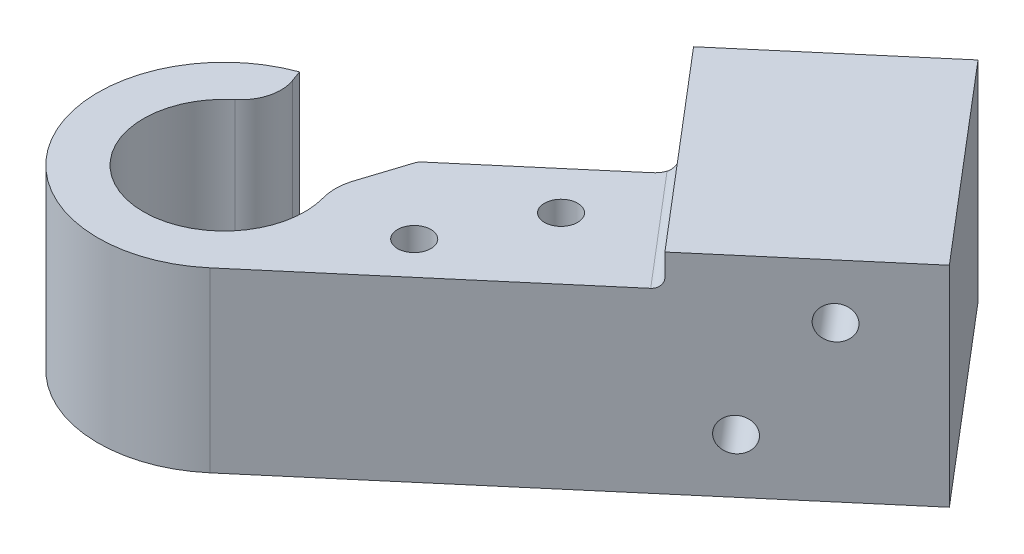
ISO-10303-21;
HEADER;
FILE_DESCRIPTION(('STEP AP214'),'2;1');
FILE_NAME('part.step','',(''),(''),'','','');
FILE_SCHEMA(('AUTOMOTIVE_DESIGN { 1 0 10303 214 1 1 1 1 }'));
ENDSEC;
DATA;
#1=APPLICATION_CONTEXT('core data for automotive mechanical design processes');
#2=APPLICATION_PROTOCOL_DEFINITION('international standard','automotive_design',2000,#1);
#3=PRODUCT_CONTEXT('',#1,'mechanical');
#4=PRODUCT('Part','Part','',(#3));
#5=PRODUCT_RELATED_PRODUCT_CATEGORY('part','',(#4));
#6=PRODUCT_DEFINITION_FORMATION('','',#4);
#7=PRODUCT_DEFINITION_CONTEXT('part definition',#1,'design');
#8=PRODUCT_DEFINITION('design','',#6,#7);
#9=PRODUCT_DEFINITION_SHAPE('','',#8);
#10=(LENGTH_UNIT() NAMED_UNIT(*) SI_UNIT(.MILLI.,.METRE.));
#11=(NAMED_UNIT(*) PLANE_ANGLE_UNIT() SI_UNIT($,.RADIAN.));
#12=(NAMED_UNIT(*) SI_UNIT($,.STERADIAN.) SOLID_ANGLE_UNIT());
#13=UNCERTAINTY_MEASURE_WITH_UNIT(LENGTH_MEASURE(1.E-05),#10,'distance_accuracy_value','');
#14=(GEOMETRIC_REPRESENTATION_CONTEXT(3) GLOBAL_UNCERTAINTY_ASSIGNED_CONTEXT((#13)) GLOBAL_UNIT_ASSIGNED_CONTEXT((#10,
#11,#12)) REPRESENTATION_CONTEXT('',''));
#15=CARTESIAN_POINT('',(0.,0.,0.));
#16=DIRECTION('',(0.,0.,1.));
#17=DIRECTION('',(1.,0.,0.));
#18=AXIS2_PLACEMENT_3D('',#15,#16,#17);
#19=CARTESIAN_POINT('',(0.,17.6,0.));
#20=DIRECTION('',(0.,-1.,0.));
#21=DIRECTION('',(0.,0.,-1.));
#22=AXIS2_PLACEMENT_3D('',#19,#20,#21);
#23=CYLINDRICAL_SURFACE('',#22,12.5);
#24=DIRECTION('',(0.,1.,0.));
#25=VECTOR('',#24,1.);
#26=CARTESIAN_POINT('',(8.10037181798933,0.,9.52018783482365));
#27=LINE('',#26,#25);
#28=CARTESIAN_POINT('',(8.10037181798933,0.,9.52018783482365));
#29=VERTEX_POINT('',#28);
#30=CARTESIAN_POINT('',(8.10037181798933,17.6,9.52018783482365));
#31=VERTEX_POINT('',#30);
#32=EDGE_CURVE('E294',#29,#31,#27,.T.);
#33=ORIENTED_EDGE('',*,*,#32,.T.);
#34=CARTESIAN_POINT('',(0.,17.6,0.));
#35=DIRECTION('',(0.,1.,0.));
#36=DIRECTION('',(0.,0.,1.));
#37=AXIS2_PLACEMENT_3D('',#34,#35,#36);
#38=CIRCLE('',#37,12.5);
#39=CARTESIAN_POINT('',(-4.27525179157087,17.6,-11.7461577598239));
#40=VERTEX_POINT('',#39);
#41=EDGE_CURVE('E318',#40,#31,#38,.T.);
#42=ORIENTED_EDGE('',*,*,#41,.F.);
#43=DIRECTION('',(0.,1.,0.));
#44=VECTOR('',#43,1.);
#45=CARTESIAN_POINT('',(-4.27525179157087,0.,-11.7461577598239));
#46=LINE('',#45,#44);
#47=CARTESIAN_POINT('',(-4.27525179157087,0.,-11.7461577598239));
#48=VERTEX_POINT('',#47);
#49=EDGE_CURVE('E307',#48,#40,#46,.T.);
#50=ORIENTED_EDGE('',*,*,#49,.F.);
#51=CARTESIAN_POINT('',(0.,0.,0.));
#52=DIRECTION('',(0.,1.,0.));
#53=DIRECTION('',(0.,0.,1.));
#54=AXIS2_PLACEMENT_3D('',#51,#52,#53);
#55=CIRCLE('',#54,12.5);
#56=EDGE_CURVE('E322',#48,#29,#55,.T.);
#57=ORIENTED_EDGE('',*,*,#56,.T.);
#58=EDGE_LOOP('',(#33,#42,#50,#57));
#59=FACE_BOUND('',#58,.T.);
#60=ADVANCED_FACE('F40',(#59),#23,.T.);
#61=CARTESIAN_POINT('',(0.,17.6,0.));
#62=DIRECTION('',(0.,1.,0.));
#63=DIRECTION('',(0.,0.,1.));
#64=AXIS2_PLACEMENT_3D('',#61,#62,#63);
#65=PLANE('',#64);
#66=DIRECTION('',(-0.761615026785892,0.,0.648029745439147));
#67=VECTOR('',#66,1.);
#68=CARTESIAN_POINT('',(-0.972044618158711,17.6,-1.14242254017883));
#69=LINE('',#68,#67);
#70=CARTESIAN_POINT('',(21.876406185418,17.6,-20.5833149033532));
#71=VERTEX_POINT('',#70);
#72=CARTESIAN_POINT('',(9.54279181840695,17.6,-10.0891036581677));
#73=VERTEX_POINT('',#72);
#74=EDGE_CURVE('E287',#71,#73,#69,.T.);
#75=ORIENTED_EDGE('',*,*,#74,.T.);
#76=CARTESIAN_POINT('',(10.1908215638461,17.6,-9.32748863138178));
#77=DIRECTION('',(0.,1.,0.));
#78=DIRECTION('',(0.,0.,1.));
#79=AXIS2_PLACEMENT_3D('',#76,#77,#78);
#80=CIRCLE('',#79,1.);
#81=CARTESIAN_POINT('',(9.23878749125801,17.6,-9.63348066498943));
#82=VERTEX_POINT('',#81);
#83=EDGE_CURVE('E62',#73,#82,#80,.T.);
#84=ORIENTED_EDGE('',*,*,#83,.T.);
#85=DIRECTION('',(0.30599203360765,0.,-0.952034072588085));
#86=VECTOR('',#85,1.);
#87=CARTESIAN_POINT('',(7.23783197852432,17.6,-3.40790085692802));
#88=LINE('',#87,#86);
#89=CARTESIAN_POINT('',(7.75951698939262,17.6,-5.03102123574787));
#90=VERTEX_POINT('',#89);
#91=EDGE_CURVE('E206',#90,#82,#88,.T.);
#92=ORIENTED_EDGE('',*,*,#91,.F.);
#93=CARTESIAN_POINT('',(12.519687352333,17.6,-3.50106106770962));
#94=DIRECTION('',(0.,1.,0.));
#95=DIRECTION('',(0.,0.,1.));
#96=AXIS2_PLACEMENT_3D('',#93,#94,#95);
#97=CIRCLE('',#96,5.);
#98=CARTESIAN_POINT('',(7.7044229860511,17.6,-2.15449911859054));
#99=VERTEX_POINT('',#98);
#100=EDGE_CURVE('E522',#90,#99,#97,.T.);
#101=ORIENTED_EDGE('',*,*,#100,.T.);
#102=CARTESIAN_POINT('',(0.,17.6,0.));
#103=DIRECTION('',(0.,1.,0.));
#104=DIRECTION('',(0.,0.,1.));
#105=AXIS2_PLACEMENT_3D('',#102,#103,#104);
#106=CIRCLE('',#105,8.);
#107=CARTESIAN_POINT('',(-5.0855244570075,17.6,-6.17555187794408));
#108=VERTEX_POINT('',#107);
#109=EDGE_CURVE('E311',#108,#99,#106,.T.);
#110=ORIENTED_EDGE('',*,*,#109,.F.);
#111=CARTESIAN_POINT('',(-7.62828668551125,17.6,-9.26332781691611));
#112=DIRECTION('',(0.,1.,0.));
#113=DIRECTION('',(0.,0.,1.));
#114=AXIS2_PLACEMENT_3D('',#111,#112,#113);
#115=CIRCLE('',#114,4.);
#116=CARTESIAN_POINT('',(-3.86951620236762,17.6,-10.6314083902188));
#117=VERTEX_POINT('',#116);
#118=EDGE_CURVE('E336',#108,#117,#115,.T.);
#119=ORIENTED_EDGE('',*,*,#118,.T.);
#120=DIRECTION('',(-0.34202014332567,0.,-0.939692620785908));
#121=VECTOR('',#120,1.);
#122=CARTESIAN_POINT('',(0.,17.6,0.));
#123=LINE('',#122,#121);
#124=EDGE_CURVE('E299',#117,#40,#123,.T.);
#125=ORIENTED_EDGE('',*,*,#124,.T.);
#126=ORIENTED_EDGE('',*,*,#41,.T.);
#127=DIRECTION('',(0.761615026785892,0.,-0.648029745439146));
#128=VECTOR('',#127,1.);
#129=CARTESIAN_POINT('',(8.10037181798933,17.6,9.52018783482365));
#130=LINE('',#129,#128);
#131=CARTESIAN_POINT('',(31.710437648352,17.6,-10.5687342737899));
#132=VERTEX_POINT('',#131);
#133=EDGE_CURVE('E292',#31,#132,#130,.T.);
#134=ORIENTED_EDGE('',*,*,#133,.T.);
#135=DIRECTION('',(-0.648029745439148,0.,-0.761615026785891));
#136=VECTOR('',#135,1.);
#137=CARTESIAN_POINT('',(22.6380212122039,17.6,-21.2313446487924));
#138=LINE('',#137,#136);
#139=CARTESIAN_POINT('',(22.4643821652422,17.6,-21.4354187801631));
#140=VERTEX_POINT('',#139);
#141=EDGE_CURVE('E341',#132,#140,#138,.T.);
#142=ORIENTED_EDGE('',*,*,#141,.T.);
#143=CARTESIAN_POINT('',(20.5803466945397,17.6,-22.106544956925));
#144=DIRECTION('',(0.,1.,0.));
#145=DIRECTION('',(0.,0.,1.));
#146=AXIS2_PLACEMENT_3D('',#143,#144,#145);
#147=CIRCLE('',#146,2.);
#148=EDGE_CURVE('E377',#140,#71,#147,.F.);
#149=ORIENTED_EDGE('',*,*,#148,.T.);
#150=EDGE_LOOP('',(#75,#84,#92,#101,#110,#119,#125,#126,#134,#142,#149));
#151=FACE_BOUND('',#150,.T.);
#152=CARTESIAN_POINT('',(20.7850198838034,17.6,-12.6071628377436));
#153=DIRECTION('',(0.,1.,0.));
#154=DIRECTION('',(0.,0.,1.));
#155=AXIS2_PLACEMENT_3D('',#152,#153,#154);
#156=CIRCLE('',#155,1.64999999999999);
#157=CARTESIAN_POINT('',(20.7850198838034,17.6,-10.9571628377436));
#158=VERTEX_POINT('',#157);
#159=EDGE_CURVE('E217',#158,#158,#156,.T.);
#160=ORIENTED_EDGE('',*,*,#159,.F.);
#161=EDGE_LOOP('',(#160));
#162=FACE_BOUND('',#161,.T.);
#163=CARTESIAN_POINT('',(15.7609885977011,17.6,-3.08040527620853));
#164=DIRECTION('',(0.,1.,0.));
#165=DIRECTION('',(0.,0.,1.));
#166=AXIS2_PLACEMENT_3D('',#163,#164,#165);
#167=CIRCLE('',#166,1.64999999999999);
#168=CARTESIAN_POINT('',(15.7609885977011,17.6,-1.43040527620854));
#169=VERTEX_POINT('',#168);
#170=EDGE_CURVE('E230',#169,#169,#167,.T.);
#171=ORIENTED_EDGE('',*,*,#170,.F.);
#172=EDGE_LOOP('',(#171));
#173=FACE_BOUND('',#172,.T.);
#174=ADVANCED_FACE('F403',(#151,#162,#173),#65,.T.);
#175=CARTESIAN_POINT('',(0.,-22.6274169979695,0.));
#176=DIRECTION('',(0.,1.,0.));
#177=DIRECTION('',(0.,0.,1.));
#178=AXIS2_PLACEMENT_3D('',#175,#176,#177);
#179=CYLINDRICAL_SURFACE('',#178,8.);
#180=ORIENTED_EDGE('',*,*,#109,.T.);
#181=DIRECTION('',(0.,1.,0.));
#182=VECTOR('',#181,1.);
#183=CARTESIAN_POINT('',(7.7044229860511,-22.6274169979695,-2.15449911859054));
#184=LINE('',#183,#182);
#185=CARTESIAN_POINT('',(7.7044229860511,2.,-2.15449911859054));
#186=VERTEX_POINT('',#185);
#187=EDGE_CURVE('E516',#99,#186,#184,.F.);
#188=ORIENTED_EDGE('',*,*,#187,.T.);
#189=CARTESIAN_POINT('',(0.,2.,0.));
#190=DIRECTION('',(0.,1.,0.));
#191=DIRECTION('',(0.,0.,1.));
#192=AXIS2_PLACEMENT_3D('',#189,#190,#191);
#193=CIRCLE('',#192,8.);
#194=CARTESIAN_POINT('',(-5.0855244570075,2.,-6.17555187794408));
#195=VERTEX_POINT('',#194);
#196=EDGE_CURVE('E314',#186,#195,#193,.F.);
#197=ORIENTED_EDGE('',*,*,#196,.T.);
#198=DIRECTION('',(0.,1.,0.));
#199=VECTOR('',#198,1.);
#200=CARTESIAN_POINT('',(-5.0855244570075,-22.6274169979695,-6.17555187794407));
#201=LINE('',#200,#199);
#202=EDGE_CURVE('E334',#195,#108,#201,.T.);
#203=ORIENTED_EDGE('',*,*,#202,.T.);
#204=EDGE_LOOP('',(#180,#188,#197,#203));
#205=FACE_BOUND('',#204,.T.);
#206=ADVANCED_FACE('F408',(#205),#179,.F.);
#207=CARTESIAN_POINT('',(0.,-33.2,0.));
#208=DIRECTION('',(0.,1.,0.));
#209=DIRECTION('',(0.,0.,1.));
#210=AXIS2_PLACEMENT_3D('',#207,#208,#209);
#211=CYLINDRICAL_SURFACE('',#210,6.875);
#212=CARTESIAN_POINT('',(0.,0.,0.));
#213=DIRECTION('',(0.,1.,0.));
#214=DIRECTION('',(0.,0.,1.));
#215=AXIS2_PLACEMENT_3D('',#212,#213,#214);
#216=CIRCLE('',#215,6.875);
#217=CARTESIAN_POINT('',(0.,0.,6.875));
#218=VERTEX_POINT('',#217);
#219=EDGE_CURVE('E324',#218,#218,#216,.T.);
#220=ORIENTED_EDGE('',*,*,#219,.F.);
#221=EDGE_LOOP('',(#220));
#222=FACE_BOUND('',#221,.T.);
#223=CARTESIAN_POINT('',(0.,2.,0.));
#224=DIRECTION('',(0.,1.,0.));
#225=DIRECTION('',(0.,0.,1.));
#226=AXIS2_PLACEMENT_3D('',#223,#224,#225);
#227=CIRCLE('',#226,6.875);
#228=CARTESIAN_POINT('',(0.,2.,6.875));
#229=VERTEX_POINT('',#228);
#230=EDGE_CURVE('E317',#229,#229,#227,.F.);
#231=ORIENTED_EDGE('',*,*,#230,.F.);
#232=EDGE_LOOP('',(#231));
#233=FACE_BOUND('',#232,.T.);
#234=ADVANCED_FACE('F413',(#222,#233),#211,.F.);
#235=CARTESIAN_POINT('',(0.,0.,0.));
#236=DIRECTION('',(0.,1.,0.));
#237=DIRECTION('',(0.,0.,1.));
#238=AXIS2_PLACEMENT_3D('',#235,#236,#237);
#239=PLANE('',#238);
#240=DIRECTION('',(-0.305992033607659,0.,0.952034072588082));
#241=VECTOR('',#240,1.);
#242=CARTESIAN_POINT('',(7.92635027446587,0.,-5.55009021267158));
#243=LINE('',#242,#241);
#244=CARTESIAN_POINT('',(9.23878749125805,0.,-9.63348066498942));
#245=VERTEX_POINT('',#244);
#246=CARTESIAN_POINT('',(7.92635027446587,0.,-5.55009021267158));
#247=VERTEX_POINT('',#246);
#248=EDGE_CURVE('E220',#245,#247,#243,.T.);
#249=ORIENTED_EDGE('',*,*,#248,.F.);
#250=CARTESIAN_POINT('',(10.1908215638461,0.,-9.32748863138178));
#251=DIRECTION('',(0.,1.,0.));
#252=DIRECTION('',(0.,0.,1.));
#253=AXIS2_PLACEMENT_3D('',#250,#251,#252);
#254=CIRCLE('',#253,1.);
#255=CARTESIAN_POINT('',(9.54279181840695,0.,-10.0891036581677));
#256=VERTEX_POINT('',#255);
#257=EDGE_CURVE('E12',#245,#256,#254,.F.);
#258=ORIENTED_EDGE('',*,*,#257,.T.);
#259=DIRECTION('',(-0.761615026785892,0.,0.648029745439147));
#260=VECTOR('',#259,1.);
#261=CARTESIAN_POINT('',(-0.972044618158711,0.,-1.14242254017883));
#262=LINE('',#261,#260);
#263=CARTESIAN_POINT('',(21.876406185418,0.,-20.5833149033532));
#264=VERTEX_POINT('',#263);
#265=EDGE_CURVE('E288',#264,#256,#262,.T.);
#266=ORIENTED_EDGE('',*,*,#265,.F.);
#267=CARTESIAN_POINT('',(20.5803466945397,0.,-22.106544956925));
#268=DIRECTION('',(0.,1.,0.));
#269=DIRECTION('',(0.,0.,1.));
#270=AXIS2_PLACEMENT_3D('',#267,#268,#269);
#271=CIRCLE('',#270,2.);
#272=CARTESIAN_POINT('',(22.1035767481115,0.,-23.4026044478033));
#273=VERTEX_POINT('',#272);
#274=EDGE_CURVE('E527',#264,#273,#271,.T.);
#275=ORIENTED_EDGE('',*,*,#274,.T.);
#276=DIRECTION('',(-0.648029745439148,0.,-0.761615026785891));
#277=VECTOR('',#276,1.);
#278=CARTESIAN_POINT('',(32.4720526751379,0.,-11.2167640192291));
#279=LINE('',#278,#277);
#280=CARTESIAN_POINT('',(16.2713090391592,0.,-30.2571396888764));
#281=VERTEX_POINT('',#280);
#282=EDGE_CURVE('E274',#273,#281,#279,.T.);
#283=ORIENTED_EDGE('',*,*,#282,.T.);
#284=DIRECTION('',(-0.761615026785891,0.,0.648029745439148));
#285=VECTOR('',#284,1.);
#286=CARTESIAN_POINT('',(31.503609574877,0.,-43.2177345976593));
#287=LINE('',#286,#285);
#288=CARTESIAN_POINT('',(31.503609574877,0.,-43.2177345976593));
#289=VERTEX_POINT('',#288);
#290=EDGE_CURVE('E284',#289,#281,#287,.T.);
#291=ORIENTED_EDGE('',*,*,#290,.F.);
#292=DIRECTION('',(-0.648029745439148,0.,-0.761615026785891));
#293=VECTOR('',#292,1.);
#294=CARTESIAN_POINT('',(47.7043532108557,0.,-24.177358928012));
#295=LINE('',#294,#293);
#296=CARTESIAN_POINT('',(47.7043532108557,0.,-24.177358928012));
#297=VERTEX_POINT('',#296);
#298=EDGE_CURVE('E264',#297,#289,#295,.T.);
#299=ORIENTED_EDGE('',*,*,#298,.F.);
#300=DIRECTION('',(0.761615026785892,0.,-0.648029745439146));
#301=VECTOR('',#300,1.);
#302=CARTESIAN_POINT('',(8.10037181798933,0.,9.52018783482365));
#303=LINE('',#302,#301);
#304=EDGE_CURVE('E291',#29,#297,#303,.T.);
#305=ORIENTED_EDGE('',*,*,#304,.F.);
#306=ORIENTED_EDGE('',*,*,#56,.F.);
#307=DIRECTION('',(-0.34202014332567,0.,-0.939692620785908));
#308=VECTOR('',#307,1.);
#309=CARTESIAN_POINT('',(0.,0.,0.));
#310=LINE('',#309,#308);
#311=CARTESIAN_POINT('',(-3.05912116060168,0.,-8.40486631212889));
#312=VERTEX_POINT('',#311);
#313=EDGE_CURVE('E300',#312,#48,#310,.T.);
#314=ORIENTED_EDGE('',*,*,#313,.F.);
#315=CARTESIAN_POINT('',(-2.11942853981577,0.,-8.74688645545456));
#316=DIRECTION('',(0.,1.,0.));
#317=DIRECTION('',(0.,0.,1.));
#318=AXIS2_PLACEMENT_3D('',#315,#316,#317);
#319=CIRCLE('',#318,1.);
#320=CARTESIAN_POINT('',(-1.88393647983624,0.,-7.77501018262627));
#321=VERTEX_POINT('',#320);
#322=EDGE_CURVE('E357',#312,#321,#319,.T.);
#323=ORIENTED_EDGE('',*,*,#322,.T.);
#324=CARTESIAN_POINT('',(0.,0.,0.));
#325=DIRECTION('',(0.,1.,0.));
#326=DIRECTION('',(0.,0.,1.));
#327=AXIS2_PLACEMENT_3D('',#324,#325,#326);
#328=CIRCLE('',#327,8.);
#329=CARTESIAN_POINT('',(6.00279305191234,0.,-5.28833391304983));
#330=VERTEX_POINT('',#329);
#331=EDGE_CURVE('E302',#321,#330,#328,.F.);
#332=ORIENTED_EDGE('',*,*,#331,.T.);
#333=CARTESIAN_POINT('',(6.75314218340138,0.,-5.94937565218106));
#334=DIRECTION('',(0.,1.,0.));
#335=DIRECTION('',(0.,0.,1.));
#336=AXIS2_PLACEMENT_3D('',#333,#334,#335);
#337=CIRCLE('',#336,1.);
#338=CARTESIAN_POINT('',(7.32671861975243,0.,-5.13022360789207));
#339=VERTEX_POINT('',#338);
#340=EDGE_CURVE('E361',#330,#339,#337,.T.);
#341=ORIENTED_EDGE('',*,*,#340,.T.);
#342=DIRECTION('',(0.819152044288993,0.,-0.573576436351044));
#343=VECTOR('',#342,1.);
#344=CARTESIAN_POINT('',(0.,0.,0.));
#345=LINE('',#344,#343);
#346=EDGE_CURVE('E305',#339,#247,#345,.T.);
#347=ORIENTED_EDGE('',*,*,#346,.T.);
#348=EDGE_LOOP('',(#249,#258,#266,#275,#283,#291,#299,#305,#306,#314,#323,#332,#341,#347));
#349=FACE_BOUND('',#348,.T.);
#350=ORIENTED_EDGE('',*,*,#219,.T.);
#351=EDGE_LOOP('',(#350));
#352=FACE_BOUND('',#351,.T.);
#353=ADVANCED_FACE('F411',(#349,#352),#239,.F.);
#354=CARTESIAN_POINT('',(0.,2.,0.));
#355=DIRECTION('',(0.,1.,0.));
#356=DIRECTION('',(0.,0.,1.));
#357=AXIS2_PLACEMENT_3D('',#354,#355,#356);
#358=PLANE('',#357);
#359=ORIENTED_EDGE('',*,*,#196,.F.);
#360=CARTESIAN_POINT('',(12.519687352333,2.,-3.50106106770962));
#361=DIRECTION('',(0.,1.,0.));
#362=DIRECTION('',(0.,0.,1.));
#363=AXIS2_PLACEMENT_3D('',#360,#361,#362);
#364=CIRCLE('',#363,5.);
#365=CARTESIAN_POINT('',(7.75951698939262,2.,-5.03102123574787));
#366=VERTEX_POINT('',#365);
#367=EDGE_CURVE('E202',#186,#366,#364,.F.);
#368=ORIENTED_EDGE('',*,*,#367,.T.);
#369=DIRECTION('',(-0.30599203360765,0.,0.952034072588085));
#370=VECTOR('',#369,1.);
#371=CARTESIAN_POINT('',(7.23783197852432,2.,-3.40790085692802));
#372=LINE('',#371,#370);
#373=CARTESIAN_POINT('',(7.92635027446587,2.,-5.55009021267158));
#374=VERTEX_POINT('',#373);
#375=EDGE_CURVE('E193',#374,#366,#372,.T.);
#376=ORIENTED_EDGE('',*,*,#375,.F.);
#377=DIRECTION('',(-0.819152044288993,0.,0.573576436351044));
#378=VECTOR('',#377,1.);
#379=CARTESIAN_POINT('',(0.,2.,0.));
#380=LINE('',#379,#378);
#381=CARTESIAN_POINT('',(7.32671861975243,2.,-5.13022360789207));
#382=VERTEX_POINT('',#381);
#383=EDGE_CURVE('E199',#374,#382,#380,.T.);
#384=ORIENTED_EDGE('',*,*,#383,.T.);
#385=CARTESIAN_POINT('',(6.75314218340138,2.,-5.94937565218106));
#386=DIRECTION('',(0.,1.,0.));
#387=DIRECTION('',(0.,0.,1.));
#388=AXIS2_PLACEMENT_3D('',#385,#386,#387);
#389=CIRCLE('',#388,1.);
#390=CARTESIAN_POINT('',(6.00279305191234,2.,-5.28833391304983));
#391=VERTEX_POINT('',#390);
#392=EDGE_CURVE('E359',#382,#391,#389,.F.);
#393=ORIENTED_EDGE('',*,*,#392,.T.);
#394=CARTESIAN_POINT('',(-1.88393647983624,2.,-7.77501018262627));
#395=VERTEX_POINT('',#394);
#396=EDGE_CURVE('E315',#395,#391,#193,.F.);
#397=ORIENTED_EDGE('',*,*,#396,.F.);
#398=CARTESIAN_POINT('',(-2.11942853981577,2.,-8.74688645545456));
#399=DIRECTION('',(0.,1.,0.));
#400=DIRECTION('',(0.,0.,1.));
#401=AXIS2_PLACEMENT_3D('',#398,#399,#400);
#402=CIRCLE('',#401,1.);
#403=CARTESIAN_POINT('',(-3.05912116060167,2.,-8.40486631212889));
#404=VERTEX_POINT('',#403);
#405=EDGE_CURVE('E355',#395,#404,#402,.F.);
#406=ORIENTED_EDGE('',*,*,#405,.T.);
#407=DIRECTION('',(0.34202014332567,0.,0.939692620785908));
#408=VECTOR('',#407,1.);
#409=CARTESIAN_POINT('',(0.,2.,0.));
#410=LINE('',#409,#408);
#411=CARTESIAN_POINT('',(-3.86951620236761,2.,-10.6314083902188));
#412=VERTEX_POINT('',#411);
#413=EDGE_CURVE('E321',#412,#404,#410,.T.);
#414=ORIENTED_EDGE('',*,*,#413,.F.);
#415=CARTESIAN_POINT('',(-7.62828668551125,2.,-9.26332781691611));
#416=DIRECTION('',(0.,1.,0.));
#417=DIRECTION('',(0.,0.,1.));
#418=AXIS2_PLACEMENT_3D('',#415,#416,#417);
#419=CIRCLE('',#418,4.);
#420=EDGE_CURVE('E338',#412,#195,#419,.F.);
#421=ORIENTED_EDGE('',*,*,#420,.T.);
#422=EDGE_LOOP('',(#359,#368,#376,#384,#393,#397,#406,#414,#421));
#423=FACE_BOUND('',#422,.T.);
#424=ORIENTED_EDGE('',*,*,#230,.T.);
#425=EDGE_LOOP('',(#424));
#426=FACE_BOUND('',#425,.T.);
#427=ADVANCED_FACE('F196',(#423,#426),#358,.T.);
#428=CARTESIAN_POINT('',(0.,0.,0.));
#429=DIRECTION('',(0.939692620785908,0.,-0.34202014332567));
#430=DIRECTION('',(-0.34202014332567,0.,-0.939692620785908));
#431=AXIS2_PLACEMENT_3D('',#428,#429,#430);
#432=PLANE('',#431);
#433=ORIENTED_EDGE('',*,*,#413,.T.);
#434=DIRECTION('',(0.,1.,0.));
#435=VECTOR('',#434,1.);
#436=CARTESIAN_POINT('',(-3.05912116060167,0.,-8.40486631212889));
#437=LINE('',#436,#435);
#438=EDGE_CURVE('E352',#404,#312,#437,.F.);
#439=ORIENTED_EDGE('',*,*,#438,.T.);
#440=ORIENTED_EDGE('',*,*,#313,.T.);
#441=ORIENTED_EDGE('',*,*,#49,.T.);
#442=ORIENTED_EDGE('',*,*,#124,.F.);
#443=DIRECTION('',(0.,-1.,0.));
#444=VECTOR('',#443,1.);
#445=CARTESIAN_POINT('',(-3.86951620236761,1.99999999999999,-10.6314083902188));
#446=LINE('',#445,#444);
#447=EDGE_CURVE('E331',#117,#412,#446,.T.);
#448=ORIENTED_EDGE('',*,*,#447,.T.);
#449=EDGE_LOOP('',(#433,#439,#440,#441,#442,#448));
#450=FACE_BOUND('',#449,.T.);
#451=ADVANCED_FACE('F424',(#450),#432,.T.);
#452=CARTESIAN_POINT('',(0.,0.,0.));
#453=DIRECTION('',(0.573576436351044,0.,0.819152044288993));
#454=DIRECTION('',(0.819152044288993,0.,-0.573576436351044));
#455=AXIS2_PLACEMENT_3D('',#452,#453,#454);
#456=PLANE('',#455);
#457=ORIENTED_EDGE('',*,*,#383,.F.);
#458=DIRECTION('',(0.,1.,0.));
#459=VECTOR('',#458,1.);
#460=CARTESIAN_POINT('',(7.92635027446587,0.,-5.55009021267158));
#461=LINE('',#460,#459);
#462=EDGE_CURVE('E213',#247,#374,#461,.T.);
#463=ORIENTED_EDGE('',*,*,#462,.F.);
#464=ORIENTED_EDGE('',*,*,#346,.F.);
#465=DIRECTION('',(0.,-1.,0.));
#466=VECTOR('',#465,1.);
#467=CARTESIAN_POINT('',(7.32671861975243,2.,-5.13022360789207));
#468=LINE('',#467,#466);
#469=EDGE_CURVE('E216',#339,#382,#468,.F.);
#470=ORIENTED_EDGE('',*,*,#469,.T.);
#471=EDGE_LOOP('',(#457,#463,#464,#470));
#472=FACE_BOUND('',#471,.T.);
#473=ADVANCED_FACE('F211',(#472),#456,.F.);
#474=CARTESIAN_POINT('',(0.,0.,0.));
#475=DIRECTION('',(0.,1.,0.));
#476=DIRECTION('',(0.,0.,1.));
#477=AXIS2_PLACEMENT_3D('',#474,#475,#476);
#478=CYLINDRICAL_SURFACE('',#477,8.);
#479=ORIENTED_EDGE('',*,*,#331,.F.);
#480=DIRECTION('',(0.,1.,0.));
#481=VECTOR('',#480,1.);
#482=CARTESIAN_POINT('',(-1.88393647983624,0.,-7.77501018262627));
#483=LINE('',#482,#481);
#484=EDGE_CURVE('E349',#321,#395,#483,.T.);
#485=ORIENTED_EDGE('',*,*,#484,.T.);
#486=ORIENTED_EDGE('',*,*,#396,.T.);
#487=DIRECTION('',(0.,1.,0.));
#488=VECTOR('',#487,1.);
#489=CARTESIAN_POINT('',(6.00279305191234,0.,-5.28833391304983));
#490=LINE('',#489,#488);
#491=EDGE_CURVE('E347',#391,#330,#490,.F.);
#492=ORIENTED_EDGE('',*,*,#491,.T.);
#493=EDGE_LOOP('',(#479,#485,#486,#492));
#494=FACE_BOUND('',#493,.T.);
#495=ADVANCED_FACE('F428',(#494),#478,.T.);
#496=CARTESIAN_POINT('',(-0.972044618158711,0.,-1.14242254017883));
#497=DIRECTION('',(-0.648029745439147,0.,-0.761615026785892));
#498=DIRECTION('',(-0.761615026785892,0.,0.648029745439147));
#499=AXIS2_PLACEMENT_3D('',#496,#497,#498);
#500=PLANE('',#499);
#501=ORIENTED_EDGE('',*,*,#265,.T.);
#502=DIRECTION('',(0.,1.,0.));
#503=VECTOR('',#502,1.);
#504=CARTESIAN_POINT('',(9.54279181840695,17.6,-10.0891036581677));
#505=LINE('',#504,#503);
#506=EDGE_CURVE('E518',#256,#73,#505,.T.);
#507=ORIENTED_EDGE('',*,*,#506,.T.);
#508=ORIENTED_EDGE('',*,*,#74,.F.);
#509=DIRECTION('',(0.,1.,0.));
#510=VECTOR('',#509,1.);
#511=CARTESIAN_POINT('',(21.876406185418,0.,-20.5833149033532));
#512=LINE('',#511,#510);
#513=EDGE_CURVE('E366',#71,#264,#512,.F.);
#514=ORIENTED_EDGE('',*,*,#513,.T.);
#515=EDGE_LOOP('',(#501,#507,#508,#514));
#516=FACE_BOUND('',#515,.T.);
#517=ADVANCED_FACE('F431',(#516),#500,.T.);
#518=CARTESIAN_POINT('',(8.10037181798933,0.,9.52018783482365));
#519=DIRECTION('',(0.648029745439147,0.,0.761615026785892));
#520=DIRECTION('',(0.761615026785892,0.,-0.648029745439147));
#521=AXIS2_PLACEMENT_3D('',#518,#519,#520);
#522=PLANE('',#521);
#523=CARTESIAN_POINT('',(41.6114329965686,15.3875,-18.9931209644988));
#524=DIRECTION('',(0.648029745439147,0.,0.761615026785892));
#525=DIRECTION('',(0.761615026785892,0.,-0.648029745439147));
#526=AXIS2_PLACEMENT_3D('',#523,#524,#525);
#527=CIRCLE('',#526,1.64999999999999);
#528=CARTESIAN_POINT('',(42.8680977907653,15.3875,-20.0623700444734));
#529=VERTEX_POINT('',#528);
#530=EDGE_CURVE('E236',#529,#529,#527,.T.);
#531=ORIENTED_EDGE('',*,*,#530,.F.);
#532=EDGE_LOOP('',(#531));
#533=FACE_BOUND('',#532,.T.);
#534=CARTESIAN_POINT('',(36.2801278090673,5.38749999999999,-14.4569127464248));
#535=DIRECTION('',(0.648029745439147,0.,0.761615026785892));
#536=DIRECTION('',(0.761615026785892,0.,-0.648029745439147));
#537=AXIS2_PLACEMENT_3D('',#534,#535,#536);
#538=CIRCLE('',#537,1.64999999999999);
#539=CARTESIAN_POINT('',(37.536792603264,5.38749999999999,-15.5261618263994));
#540=VERTEX_POINT('',#539);
#541=EDGE_CURVE('E242',#540,#540,#538,.T.);
#542=ORIENTED_EDGE('',*,*,#541,.F.);
#543=EDGE_LOOP('',(#542));
#544=FACE_BOUND('',#543,.T.);
#545=ORIENTED_EDGE('',*,*,#133,.F.);
#546=ORIENTED_EDGE('',*,*,#32,.F.);
#547=ORIENTED_EDGE('',*,*,#304,.T.);
#548=DIRECTION('',(0.,-1.,0.));
#549=VECTOR('',#548,1.);
#550=CARTESIAN_POINT('',(47.7043532108557,0.,-24.177358928012));
#551=LINE('',#550,#549);
#552=CARTESIAN_POINT('',(47.7043532108557,20.775,-24.177358928012));
#553=VERTEX_POINT('',#552);
#554=EDGE_CURVE('E261',#553,#297,#551,.T.);
#555=ORIENTED_EDGE('',*,*,#554,.F.);
#556=DIRECTION('',(-0.761615026785891,0.,0.648029745439148));
#557=VECTOR('',#556,1.);
#558=CARTESIAN_POINT('',(47.7043532108557,20.775,-24.177358928012));
#559=LINE('',#558,#557);
#560=CARTESIAN_POINT('',(32.4720526751379,20.775,-11.2167640192291));
#561=VERTEX_POINT('',#560);
#562=EDGE_CURVE('E271',#553,#561,#559,.T.);
#563=ORIENTED_EDGE('',*,*,#562,.T.);
#564=DIRECTION('',(0.,-1.,0.));
#565=VECTOR('',#564,1.);
#566=CARTESIAN_POINT('',(32.4720526751379,0.,-11.2167640192291));
#567=LINE('',#566,#565);
#568=CARTESIAN_POINT('',(32.4720526751379,18.6,-11.2167640192291));
#569=VERTEX_POINT('',#568);
#570=EDGE_CURVE('E260',#561,#569,#567,.T.);
#571=ORIENTED_EDGE('',*,*,#570,.T.);
#572=CARTESIAN_POINT('',(31.710437648352,18.6,-10.5687342737899));
#573=DIRECTION('',(0.648029745439147,0.,0.761615026785892));
#574=DIRECTION('',(0.761615026785892,0.,-0.648029745439147));
#575=AXIS2_PLACEMENT_3D('',#572,#573,#574);
#576=CIRCLE('',#575,1.);
#577=EDGE_CURVE('E345',#569,#132,#576,.F.);
#578=ORIENTED_EDGE('',*,*,#577,.T.);
#579=EDGE_LOOP('',(#545,#546,#547,#555,#563,#571,#578));
#580=FACE_BOUND('',#579,.T.);
#581=ADVANCED_FACE('F437',(#533,#544,#580),#522,.T.);
#582=CARTESIAN_POINT('',(-7.62828668551125,-22.6274169979695,-9.26332781691611));
#583=DIRECTION('',(0.,1.,0.));
#584=DIRECTION('',(0.,0.,1.));
#585=AXIS2_PLACEMENT_3D('',#582,#583,#584);
#586=CYLINDRICAL_SURFACE('',#585,4.);
#587=ORIENTED_EDGE('',*,*,#118,.F.);
#588=ORIENTED_EDGE('',*,*,#202,.F.);
#589=ORIENTED_EDGE('',*,*,#420,.F.);
#590=ORIENTED_EDGE('',*,*,#447,.F.);
#591=EDGE_LOOP('',(#587,#588,#589,#590));
#592=FACE_BOUND('',#591,.T.);
#593=ADVANCED_FACE('F390',(#592),#586,.T.);
#594=CARTESIAN_POINT('',(24.3716808571485,0.,-20.7369518540527));
#595=DIRECTION('',(-0.761615026785891,0.,0.648029745439148));
#596=DIRECTION('',(0.648029745439148,0.,0.761615026785891));
#597=AXIS2_PLACEMENT_3D('',#594,#595,#596);
#598=PLANE('',#597);
#599=ORIENTED_EDGE('',*,*,#282,.F.);
#600=DIRECTION('',(0.,1.,0.));
#601=VECTOR('',#600,1.);
#602=CARTESIAN_POINT('',(22.1035767481115,18.6,-23.4026044478033));
#603=LINE('',#602,#601);
#604=CARTESIAN_POINT('',(22.1035767481115,18.6,-23.4026044478033));
#605=VERTEX_POINT('',#604);
#606=EDGE_CURVE('E363',#273,#605,#603,.T.);
#607=ORIENTED_EDGE('',*,*,#606,.T.);
#608=DIRECTION('',(-0.648029745439148,0.,-0.761615026785891));
#609=VECTOR('',#608,1.);
#610=CARTESIAN_POINT('',(32.4720526751379,18.6,-11.216764019229));
#611=LINE('',#610,#609);
#612=EDGE_CURVE('E343',#605,#569,#611,.F.);
#613=ORIENTED_EDGE('',*,*,#612,.T.);
#614=ORIENTED_EDGE('',*,*,#570,.F.);
#615=DIRECTION('',(0.648029745439148,0.,0.761615026785891));
#616=VECTOR('',#615,1.);
#617=CARTESIAN_POINT('',(32.4720526751379,20.775,-11.2167640192291));
#618=LINE('',#617,#616);
#619=CARTESIAN_POINT('',(16.2713090391592,20.775,-30.2571396888764));
#620=VERTEX_POINT('',#619);
#621=EDGE_CURVE('E265',#620,#561,#618,.T.);
#622=ORIENTED_EDGE('',*,*,#621,.F.);
#623=DIRECTION('',(0.,1.,0.));
#624=VECTOR('',#623,1.);
#625=CARTESIAN_POINT('',(16.2713090391592,0.,-30.2571396888764));
#626=LINE('',#625,#624);
#627=EDGE_CURVE('E276',#281,#620,#626,.T.);
#628=ORIENTED_EDGE('',*,*,#627,.F.);
#629=EDGE_LOOP('',(#599,#607,#613,#614,#622,#628));
#630=FACE_BOUND('',#629,.T.);
#631=ADVANCED_FACE('F446',(#630),#598,.T.);
#632=CARTESIAN_POINT('',(31.503609574877,0.,-43.2177345976593));
#633=DIRECTION('',(0.648029745439148,0.,0.761615026785891));
#634=DIRECTION('',(0.761615026785891,0.,-0.648029745439148));
#635=AXIS2_PLACEMENT_3D('',#632,#633,#634);
#636=PLANE('',#635);
#637=CARTESIAN_POINT('',(25.4106893605899,15.3875,-38.0334966341461));
#638=DIRECTION('',(-0.648029745439146,0.,-0.761615026785892));
#639=DIRECTION('',(-0.761615026785892,0.,0.648029745439146));
#640=AXIS2_PLACEMENT_3D('',#637,#638,#639);
#641=CIRCLE('',#640,1.64999999999999);
#642=CARTESIAN_POINT('',(24.1540245663932,15.3875,-36.9642475541715));
#643=VERTEX_POINT('',#642);
#644=EDGE_CURVE('E248',#643,#643,#641,.T.);
#645=ORIENTED_EDGE('',*,*,#644,.F.);
#646=EDGE_LOOP('',(#645));
#647=FACE_BOUND('',#646,.T.);
#648=CARTESIAN_POINT('',(20.0793841730887,5.3875,-33.497288416072));
#649=DIRECTION('',(-0.648029745439146,0.,-0.761615026785892));
#650=DIRECTION('',(-0.761615026785892,0.,0.648029745439146));
#651=AXIS2_PLACEMENT_3D('',#648,#649,#650);
#652=CIRCLE('',#651,1.64999999999999);
#653=CARTESIAN_POINT('',(18.822719378892,5.3875,-32.4280393360975));
#654=VERTEX_POINT('',#653);
#655=EDGE_CURVE('E254',#654,#654,#652,.T.);
#656=ORIENTED_EDGE('',*,*,#655,.F.);
#657=EDGE_LOOP('',(#656));
#658=FACE_BOUND('',#657,.T.);
#659=ORIENTED_EDGE('',*,*,#627,.T.);
#660=DIRECTION('',(-0.761615026785891,0.,0.648029745439148));
#661=VECTOR('',#660,1.);
#662=CARTESIAN_POINT('',(31.503609574877,20.775,-43.2177345976593));
#663=LINE('',#662,#661);
#664=CARTESIAN_POINT('',(31.503609574877,20.775,-43.2177345976593));
#665=VERTEX_POINT('',#664);
#666=EDGE_CURVE('E281',#665,#620,#663,.T.);
#667=ORIENTED_EDGE('',*,*,#666,.F.);
#668=DIRECTION('',(0.,1.,0.));
#669=VECTOR('',#668,1.);
#670=CARTESIAN_POINT('',(31.503609574877,0.,-43.2177345976593));
#671=LINE('',#670,#669);
#672=EDGE_CURVE('E267',#289,#665,#671,.T.);
#673=ORIENTED_EDGE('',*,*,#672,.F.);
#674=ORIENTED_EDGE('',*,*,#290,.T.);
#675=EDGE_LOOP('',(#659,#667,#673,#674));
#676=FACE_BOUND('',#675,.T.);
#677=ADVANCED_FACE('F442',(#647,#658,#676),#636,.F.);
#678=CARTESIAN_POINT('',(47.7043532108557,20.775,-24.177358928012));
#679=DIRECTION('',(0.,-1.,0.));
#680=DIRECTION('',(0.,0.,-1.));
#681=AXIS2_PLACEMENT_3D('',#678,#679,#680);
#682=PLANE('',#681);
#683=ORIENTED_EDGE('',*,*,#621,.T.);
#684=ORIENTED_EDGE('',*,*,#562,.F.);
#685=DIRECTION('',(0.648029745439148,0.,0.761615026785891));
#686=VECTOR('',#685,1.);
#687=CARTESIAN_POINT('',(47.7043532108557,20.775,-24.177358928012));
#688=LINE('',#687,#686);
#689=EDGE_CURVE('E269',#665,#553,#688,.T.);
#690=ORIENTED_EDGE('',*,*,#689,.F.);
#691=ORIENTED_EDGE('',*,*,#666,.T.);
#692=EDGE_LOOP('',(#683,#684,#690,#691));
#693=FACE_BOUND('',#692,.T.);
#694=ADVANCED_FACE('F445',(#693),#682,.F.);
#695=CARTESIAN_POINT('',(39.6039813928663,0.,-33.6975467628357));
#696=DIRECTION('',(-0.761615026785891,0.,0.648029745439148));
#697=DIRECTION('',(0.648029745439148,0.,0.761615026785891));
#698=AXIS2_PLACEMENT_3D('',#695,#696,#697);
#699=PLANE('',#698);
#700=ORIENTED_EDGE('',*,*,#554,.T.);
#701=ORIENTED_EDGE('',*,*,#298,.T.);
#702=ORIENTED_EDGE('',*,*,#672,.T.);
#703=ORIENTED_EDGE('',*,*,#689,.T.);
#704=EDGE_LOOP('',(#700,#701,#702,#703));
#705=FACE_BOUND('',#704,.T.);
#706=ADVANCED_FACE('F450',(#705),#699,.F.);
#707=CARTESIAN_POINT('',(24.6155923911627,5.3875,-28.1659832285708));
#708=DIRECTION('',(-0.648029745439146,0.,-0.761615026785892));
#709=DIRECTION('',(-0.761615026785892,0.,0.648029745439146));
#710=AXIS2_PLACEMENT_3D('',#707,#708,#709);
#711=CONICAL_SURFACE('',#710,1.65,1.02974425867665);
#712=CARTESIAN_POINT('',(25.2580620552509,5.3875,-27.4109028424196));
#713=VERTEX_POINT('',#712);
#714=VERTEX_LOOP('',#713);
#715=FACE_BOUND('',#714,.T.);
#716=CARTESIAN_POINT('',(24.6155923911627,5.3875,-28.1659832285708));
#717=DIRECTION('',(-0.648029745439146,0.,-0.761615026785892));
#718=DIRECTION('',(-0.761615026785892,0.,0.648029745439146));
#719=AXIS2_PLACEMENT_3D('',#716,#717,#718);
#720=CIRCLE('',#719,1.65);
#721=CARTESIAN_POINT('',(23.358927596966,5.3875,-27.0967341485962));
#722=VERTEX_POINT('',#721);
#723=EDGE_CURVE('E257',#722,#722,#720,.T.);
#724=ORIENTED_EDGE('',*,*,#723,.T.);
#725=EDGE_LOOP('',(#724));
#726=FACE_BOUND('',#725,.T.);
#727=ADVANCED_FACE('F457',(#715,#726),#711,.F.);
#728=CARTESIAN_POINT('',(20.0793841730887,5.3875,-33.497288416072));
#729=DIRECTION('',(-0.648029745439146,0.,-0.761615026785892));
#730=DIRECTION('',(-0.761615026785892,0.,0.648029745439146));
#731=AXIS2_PLACEMENT_3D('',#728,#729,#730);
#732=CYLINDRICAL_SURFACE('',#731,1.64999999999999);
#733=ORIENTED_EDGE('',*,*,#723,.F.);
#734=EDGE_LOOP('',(#733));
#735=FACE_BOUND('',#734,.T.);
#736=ORIENTED_EDGE('',*,*,#655,.T.);
#737=EDGE_LOOP('',(#736));
#738=FACE_BOUND('',#737,.T.);
#739=ADVANCED_FACE('F461',(#735,#738),#732,.F.);
#740=CARTESIAN_POINT('',(29.9468975786639,15.3875,-32.7021914466448));
#741=DIRECTION('',(-0.648029745439146,0.,-0.761615026785892));
#742=DIRECTION('',(-0.761615026785892,0.,0.648029745439146));
#743=AXIS2_PLACEMENT_3D('',#740,#741,#742);
#744=CONICAL_SURFACE('',#743,1.65,1.02974425867665);
#745=CARTESIAN_POINT('',(30.5893672427521,15.3875,-31.9471110604936));
#746=VERTEX_POINT('',#745);
#747=VERTEX_LOOP('',#746);
#748=FACE_BOUND('',#747,.T.);
#749=CARTESIAN_POINT('',(29.9468975786639,15.3875,-32.7021914466448));
#750=DIRECTION('',(-0.648029745439146,0.,-0.761615026785892));
#751=DIRECTION('',(-0.761615026785892,0.,0.648029745439146));
#752=AXIS2_PLACEMENT_3D('',#749,#750,#751);
#753=CIRCLE('',#752,1.65);
#754=CARTESIAN_POINT('',(28.6902327844672,15.3875,-31.6329423666702));
#755=VERTEX_POINT('',#754);
#756=EDGE_CURVE('E251',#755,#755,#753,.T.);
#757=ORIENTED_EDGE('',*,*,#756,.T.);
#758=EDGE_LOOP('',(#757));
#759=FACE_BOUND('',#758,.T.);
#760=ADVANCED_FACE('F465',(#748,#759),#744,.F.);
#761=CARTESIAN_POINT('',(25.4106893605899,15.3875,-38.0334966341461));
#762=DIRECTION('',(-0.648029745439146,0.,-0.761615026785892));
#763=DIRECTION('',(-0.761615026785892,0.,0.648029745439146));
#764=AXIS2_PLACEMENT_3D('',#761,#762,#763);
#765=CYLINDRICAL_SURFACE('',#764,1.64999999999999);
#766=ORIENTED_EDGE('',*,*,#756,.F.);
#767=EDGE_LOOP('',(#766));
#768=FACE_BOUND('',#767,.T.);
#769=ORIENTED_EDGE('',*,*,#644,.T.);
#770=EDGE_LOOP('',(#769));
#771=FACE_BOUND('',#770,.T.);
#772=ADVANCED_FACE('F469',(#768,#771),#765,.F.);
#773=CARTESIAN_POINT('',(31.7439195909933,5.38749999999999,-19.788217933926));
#774=DIRECTION('',(0.648029745439147,0.,0.761615026785892));
#775=DIRECTION('',(0.761615026785892,0.,-0.648029745439147));
#776=AXIS2_PLACEMENT_3D('',#773,#774,#775);
#777=CONICAL_SURFACE('',#776,1.65,1.02974425867666);
#778=CARTESIAN_POINT('',(31.1014499269051,5.38749999999999,-20.5432983200772));
#779=VERTEX_POINT('',#778);
#780=VERTEX_LOOP('',#779);
#781=FACE_BOUND('',#780,.T.);
#782=CARTESIAN_POINT('',(31.7439195909933,5.38749999999999,-19.788217933926));
#783=DIRECTION('',(0.648029745439147,0.,0.761615026785892));
#784=DIRECTION('',(0.761615026785892,0.,-0.648029745439147));
#785=AXIS2_PLACEMENT_3D('',#782,#783,#784);
#786=CIRCLE('',#785,1.65);
#787=CARTESIAN_POINT('',(33.00058438519,5.38749999999999,-20.8574670139006));
#788=VERTEX_POINT('',#787);
#789=EDGE_CURVE('E245',#788,#788,#786,.T.);
#790=ORIENTED_EDGE('',*,*,#789,.T.);
#791=EDGE_LOOP('',(#790));
#792=FACE_BOUND('',#791,.T.);
#793=ADVANCED_FACE('F473',(#781,#792),#777,.F.);
#794=CARTESIAN_POINT('',(36.2801278090673,5.38749999999999,-14.4569127464248));
#795=DIRECTION('',(0.648029745439147,0.,0.761615026785892));
#796=DIRECTION('',(0.761615026785892,0.,-0.648029745439147));
#797=AXIS2_PLACEMENT_3D('',#794,#795,#796);
#798=CYLINDRICAL_SURFACE('',#797,1.64999999999999);
#799=ORIENTED_EDGE('',*,*,#789,.F.);
#800=EDGE_LOOP('',(#799));
#801=FACE_BOUND('',#800,.T.);
#802=ORIENTED_EDGE('',*,*,#541,.T.);
#803=EDGE_LOOP('',(#802));
#804=FACE_BOUND('',#803,.T.);
#805=ADVANCED_FACE('F477',(#801,#804),#798,.F.);
#806=CARTESIAN_POINT('',(37.0752247784945,15.3875,-24.3244261520001));
#807=DIRECTION('',(0.648029745439147,0.,0.761615026785892));
#808=DIRECTION('',(0.761615026785892,0.,-0.648029745439147));
#809=AXIS2_PLACEMENT_3D('',#806,#807,#808);
#810=CONICAL_SURFACE('',#809,1.65,1.02974425867665);
#811=CARTESIAN_POINT('',(36.4327551144063,15.3875,-25.0795065381512));
#812=VERTEX_POINT('',#811);
#813=VERTEX_LOOP('',#812);
#814=FACE_BOUND('',#813,.T.);
#815=CARTESIAN_POINT('',(37.0752247784945,15.3875,-24.3244261520001));
#816=DIRECTION('',(0.648029745439147,0.,0.761615026785892));
#817=DIRECTION('',(0.761615026785892,0.,-0.648029745439147));
#818=AXIS2_PLACEMENT_3D('',#815,#816,#817);
#819=CIRCLE('',#818,1.65);
#820=CARTESIAN_POINT('',(38.3318895726912,15.3875,-25.3936752319746));
#821=VERTEX_POINT('',#820);
#822=EDGE_CURVE('E239',#821,#821,#819,.T.);
#823=ORIENTED_EDGE('',*,*,#822,.T.);
#824=EDGE_LOOP('',(#823));
#825=FACE_BOUND('',#824,.T.);
#826=ADVANCED_FACE('F481',(#814,#825),#810,.F.);
#827=CARTESIAN_POINT('',(41.6114329965686,15.3875,-18.9931209644988));
#828=DIRECTION('',(0.648029745439147,0.,0.761615026785892));
#829=DIRECTION('',(0.761615026785892,0.,-0.648029745439147));
#830=AXIS2_PLACEMENT_3D('',#827,#828,#829);
#831=CYLINDRICAL_SURFACE('',#830,1.64999999999999);
#832=ORIENTED_EDGE('',*,*,#822,.F.);
#833=EDGE_LOOP('',(#832));
#834=FACE_BOUND('',#833,.T.);
#835=ORIENTED_EDGE('',*,*,#530,.T.);
#836=EDGE_LOOP('',(#835));
#837=FACE_BOUND('',#836,.T.);
#838=ADVANCED_FACE('F485',(#834,#837),#831,.F.);
#839=CARTESIAN_POINT('',(15.7609885977011,10.6,-3.08040527620853));
#840=DIRECTION('',(0.,1.,0.));
#841=DIRECTION('',(0.,0.,1.));
#842=AXIS2_PLACEMENT_3D('',#839,#840,#841);
#843=CONICAL_SURFACE('',#842,1.65,1.02974425867665);
#844=CARTESIAN_POINT('',(15.7609885977011,9.60857997860453,-3.08040527620853));
#845=VERTEX_POINT('',#844);
#846=VERTEX_LOOP('',#845);
#847=FACE_BOUND('',#846,.T.);
#848=CARTESIAN_POINT('',(15.7609885977011,10.6,-3.08040527620853));
#849=DIRECTION('',(0.,1.,0.));
#850=DIRECTION('',(0.,0.,1.));
#851=AXIS2_PLACEMENT_3D('',#848,#849,#850);
#852=CIRCLE('',#851,1.65);
#853=CARTESIAN_POINT('',(15.7609885977011,10.6,-1.43040527620853));
#854=VERTEX_POINT('',#853);
#855=EDGE_CURVE('E233',#854,#854,#852,.T.);
#856=ORIENTED_EDGE('',*,*,#855,.T.);
#857=EDGE_LOOP('',(#856));
#858=FACE_BOUND('',#857,.T.);
#859=ADVANCED_FACE('F489',(#847,#858),#843,.F.);
#860=CARTESIAN_POINT('',(15.7609885977011,17.6,-3.08040527620853));
#861=DIRECTION('',(0.,1.,0.));
#862=DIRECTION('',(0.,0.,1.));
#863=AXIS2_PLACEMENT_3D('',#860,#861,#862);
#864=CYLINDRICAL_SURFACE('',#863,1.65);
#865=ORIENTED_EDGE('',*,*,#855,.F.);
#866=EDGE_LOOP('',(#865));
#867=FACE_BOUND('',#866,.T.);
#868=ORIENTED_EDGE('',*,*,#170,.T.);
#869=EDGE_LOOP('',(#868));
#870=FACE_BOUND('',#869,.T.);
#871=ADVANCED_FACE('F493',(#867,#870),#864,.F.);
#872=CARTESIAN_POINT('',(20.7850198838034,10.6,-12.6071628377436));
#873=DIRECTION('',(0.,1.,0.));
#874=DIRECTION('',(0.,0.,1.));
#875=AXIS2_PLACEMENT_3D('',#872,#873,#874);
#876=CONICAL_SURFACE('',#875,1.65,1.02974425867665);
#877=CARTESIAN_POINT('',(20.7850198838034,9.60857997860453,-12.6071628377436));
#878=VERTEX_POINT('',#877);
#879=VERTEX_LOOP('',#878);
#880=FACE_BOUND('',#879,.T.);
#881=CARTESIAN_POINT('',(20.7850198838034,10.6,-12.6071628377436));
#882=DIRECTION('',(0.,1.,0.));
#883=DIRECTION('',(0.,0.,1.));
#884=AXIS2_PLACEMENT_3D('',#881,#882,#883);
#885=CIRCLE('',#884,1.65);
#886=CARTESIAN_POINT('',(20.7850198838034,10.6,-10.9571628377436));
#887=VERTEX_POINT('',#886);
#888=EDGE_CURVE('E227',#887,#887,#885,.T.);
#889=ORIENTED_EDGE('',*,*,#888,.T.);
#890=EDGE_LOOP('',(#889));
#891=FACE_BOUND('',#890,.T.);
#892=ADVANCED_FACE('F497',(#880,#891),#876,.F.);
#893=CARTESIAN_POINT('',(20.7850198838034,17.6,-12.6071628377436));
#894=DIRECTION('',(0.,1.,0.));
#895=DIRECTION('',(0.,0.,1.));
#896=AXIS2_PLACEMENT_3D('',#893,#894,#895);
#897=CYLINDRICAL_SURFACE('',#896,1.64999999999999);
#898=ORIENTED_EDGE('',*,*,#888,.F.);
#899=EDGE_LOOP('',(#898));
#900=FACE_BOUND('',#899,.T.);
#901=ORIENTED_EDGE('',*,*,#159,.T.);
#902=EDGE_LOOP('',(#901));
#903=FACE_BOUND('',#902,.T.);
#904=ADVANCED_FACE('F388',(#900,#903),#897,.F.);
#905=CARTESIAN_POINT('',(23.6100658303626,18.6,-20.0889221086136));
#906=DIRECTION('',(0.648029745439148,0.,0.761615026785891));
#907=DIRECTION('',(0.761615026785891,0.,-0.648029745439148));
#908=AXIS2_PLACEMENT_3D('',#905,#906,#907);
#909=CYLINDRICAL_SURFACE('',#908,1.);
#910=ORIENTED_EDGE('',*,*,#577,.F.);
#911=ORIENTED_EDGE('',*,*,#612,.F.);
#912=CARTESIAN_POINT('',(22.4643821652422,17.6,-21.4354187801631));
#913=CARTESIAN_POINT('',(22.4789067108878,17.5999998056884,-21.4761537116862));
#914=CARTESIAN_POINT('',(22.4920684607521,17.602103197962,-21.5173201481635));
#915=CARTESIAN_POINT('',(22.5156051969201,17.6100134076426,-21.5999856181927));
#916=CARTESIAN_POINT('',(22.52598715061,17.6158108403891,-21.6414835465486));
#917=CARTESIAN_POINT('',(22.5438577607726,17.6305123591962,-21.723942182586));
#918=CARTESIAN_POINT('',(22.5513829262915,17.6393742698425,-21.7649027239194));
#919=CARTESIAN_POINT('',(22.5638082144595,17.6597852158221,-21.846566433192));
#920=CARTESIAN_POINT('',(22.568706393757,17.6713362314266,-21.8872693886431));
#921=CARTESIAN_POINT('',(22.5809729498892,17.7142327675106,-22.0239732827775));
#922=CARTESIAN_POINT('',(22.5824445752691,17.7509215034251,-22.1188866660507));
#923=CARTESIAN_POINT('',(22.5727179203614,17.8331876683941,-22.304482331464));
#924=CARTESIAN_POINT('',(22.5614428475283,17.8788175882158,-22.3951355050126));
#925=CARTESIAN_POINT('',(22.5208823912814,17.9956654044556,-22.6066980698438));
#926=CARTESIAN_POINT('',(22.4861492428627,18.0697581556716,-22.7249773190207));
#927=CARTESIAN_POINT('',(22.39802732187,18.2239793949534,-22.9495067952112));
#928=CARTESIAN_POINT('',(22.3446627919287,18.3040999340624,-23.0557724173043));
#929=CARTESIAN_POINT('',(22.2306031522248,18.4546835611495,-23.240828002803));
#930=CARTESIAN_POINT('',(22.1722250153233,18.5247822523478,-23.321345141413));
#931=CARTESIAN_POINT('',(22.1067283540327,18.5965573838849,-23.3988935694775));
#932=CARTESIAN_POINT('',(22.1051542225523,18.5982787128306,-23.4007504689837));
#933=CARTESIAN_POINT('',(22.1035767481115,18.6,-23.4026044478033));
#934=B_SPLINE_CURVE_WITH_KNOTS('',3,(#912,#913,#914,#915,#916,#917,#918,#919,#920,#921,#922,
#923,#924,#925,#926,#927,#928,#929,#930,#931,#932,#933),.UNSPECIFIED.,.F.,.F.,(4,2,2,2,2,2,2,2,
2,2,4),(0.,0.129592295294571,0.25885666865275,0.3864085092684,0.514054578529991,
0.817592410147237,1.1229686971365,1.55212503753217,1.98072504008938,2.34472916750578,
2.35367344935465),.UNSPECIFIED.);
#935=EDGE_CURVE('E368',#605,#140,#934,.F.);
#936=ORIENTED_EDGE('',*,*,#935,.T.);
#937=ORIENTED_EDGE('',*,*,#141,.F.);
#938=EDGE_LOOP('',(#910,#911,#936,#937));
#939=FACE_BOUND('',#938,.T.);
#940=ADVANCED_FACE('F382',(#939),#909,.F.);
#941=CARTESIAN_POINT('',(-2.11942853981577,0.,-8.74688645545456));
#942=DIRECTION('',(0.,1.,0.));
#943=DIRECTION('',(0.,0.,1.));
#944=AXIS2_PLACEMENT_3D('',#941,#942,#943);
#945=CYLINDRICAL_SURFACE('',#944,1.);
#946=ORIENTED_EDGE('',*,*,#322,.F.);
#947=ORIENTED_EDGE('',*,*,#438,.F.);
#948=ORIENTED_EDGE('',*,*,#405,.F.);
#949=ORIENTED_EDGE('',*,*,#484,.F.);
#950=EDGE_LOOP('',(#946,#947,#948,#949));
#951=FACE_BOUND('',#950,.T.);
#952=ADVANCED_FACE('F387',(#951),#945,.F.);
#953=CARTESIAN_POINT('',(6.75314218340138,0.,-5.94937565218106));
#954=DIRECTION('',(0.,1.,0.));
#955=DIRECTION('',(0.,0.,1.));
#956=AXIS2_PLACEMENT_3D('',#953,#954,#955);
#957=CYLINDRICAL_SURFACE('',#956,1.);
#958=ORIENTED_EDGE('',*,*,#340,.F.);
#959=ORIENTED_EDGE('',*,*,#491,.F.);
#960=ORIENTED_EDGE('',*,*,#392,.F.);
#961=ORIENTED_EDGE('',*,*,#469,.F.);
#962=EDGE_LOOP('',(#958,#959,#960,#961));
#963=FACE_BOUND('',#962,.T.);
#964=ADVANCED_FACE('F393',(#963),#957,.F.);
#965=CARTESIAN_POINT('',(20.5803466945397,0.,-22.106544956925));
#966=DIRECTION('',(0.,-1.,0.));
#967=DIRECTION('',(0.,0.,-1.));
#968=AXIS2_PLACEMENT_3D('',#965,#966,#967);
#969=CYLINDRICAL_SURFACE('',#968,2.);
#970=ORIENTED_EDGE('',*,*,#274,.F.);
#971=ORIENTED_EDGE('',*,*,#513,.F.);
#972=ORIENTED_EDGE('',*,*,#148,.F.);
#973=ORIENTED_EDGE('',*,*,#935,.F.);
#974=ORIENTED_EDGE('',*,*,#606,.F.);
#975=EDGE_LOOP('',(#970,#971,#972,#973,#974));
#976=FACE_BOUND('',#975,.T.);
#977=ADVANCED_FACE('F379',(#976),#969,.F.);
#978=CARTESIAN_POINT('',(7.23783197852432,-12.1772388266176,-3.40790085692802));
#979=DIRECTION('',(0.952034072588085,0.,0.30599203360765));
#980=DIRECTION('',(0.30599203360765,0.,-0.952034072588085));
#981=AXIS2_PLACEMENT_3D('',#978,#979,#980);
#982=PLANE('',#981);
#983=ORIENTED_EDGE('',*,*,#91,.T.);
#984=DIRECTION('',(0.,1.,0.));
#985=VECTOR('',#984,1.);
#986=CARTESIAN_POINT('',(9.23878749125801,0.,-9.63348066498943));
#987=LINE('',#986,#985);
#988=EDGE_CURVE('E48',#82,#245,#987,.F.);
#989=ORIENTED_EDGE('',*,*,#988,.T.);
#990=ORIENTED_EDGE('',*,*,#248,.T.);
#991=ORIENTED_EDGE('',*,*,#462,.T.);
#992=ORIENTED_EDGE('',*,*,#375,.T.);
#993=DIRECTION('',(0.,1.,0.));
#994=VECTOR('',#993,1.);
#995=CARTESIAN_POINT('',(7.75951698939262,-12.1772388266176,-5.03102123574787));
#996=LINE('',#995,#994);
#997=EDGE_CURVE('E517',#366,#90,#996,.T.);
#998=ORIENTED_EDGE('',*,*,#997,.T.);
#999=EDGE_LOOP('',(#983,#989,#990,#991,#992,#998));
#1000=FACE_BOUND('',#999,.T.);
#1001=ADVANCED_FACE('F219',(#1000),#982,.F.);
#1002=CARTESIAN_POINT('',(12.519687352333,-22.6274169979695,-3.50106106770962));
#1003=DIRECTION('',(0.,1.,0.));
#1004=DIRECTION('',(0.,0.,1.));
#1005=AXIS2_PLACEMENT_3D('',#1002,#1003,#1004);
#1006=CYLINDRICAL_SURFACE('',#1005,5.);
#1007=ORIENTED_EDGE('',*,*,#367,.F.);
#1008=ORIENTED_EDGE('',*,*,#187,.F.);
#1009=ORIENTED_EDGE('',*,*,#100,.F.);
#1010=ORIENTED_EDGE('',*,*,#997,.F.);
#1011=EDGE_LOOP('',(#1007,#1008,#1009,#1010));
#1012=FACE_BOUND('',#1011,.T.);
#1013=ADVANCED_FACE('F506',(#1012),#1006,.T.);
#1014=CARTESIAN_POINT('',(10.1908215638461,0.,-9.32748863138178));
#1015=DIRECTION('',(0.,-1.,0.));
#1016=DIRECTION('',(0.,0.,-1.));
#1017=AXIS2_PLACEMENT_3D('',#1014,#1015,#1016);
#1018=CYLINDRICAL_SURFACE('',#1017,1.);
#1019=ORIENTED_EDGE('',*,*,#257,.F.);
#1020=ORIENTED_EDGE('',*,*,#988,.F.);
#1021=ORIENTED_EDGE('',*,*,#83,.F.);
#1022=ORIENTED_EDGE('',*,*,#506,.F.);
#1023=EDGE_LOOP('',(#1019,#1020,#1021,#1022));
#1024=FACE_BOUND('',#1023,.T.);
#1025=ADVANCED_FACE('F42',(#1024),#1018,.T.);
#1026=CLOSED_SHELL('',(#60,#174,#206,#234,#353,#427,#451,#473,#495,#517,#581,#593,#631,#677,
#694,#706,#727,#739,#760,#772,#793,#805,#826,#838,#859,#871,#892,#904,#940,#952,#964,#977,#1001,
#1013,#1025));
#1027=MANIFOLD_SOLID_BREP('B2',#1026);
#1028=ADVANCED_BREP_SHAPE_REPRESENTATION('',(#18,#1027),#14);
#1029=SHAPE_DEFINITION_REPRESENTATION(#9,#1028);
ENDSEC;
END-ISO-10303-21;
